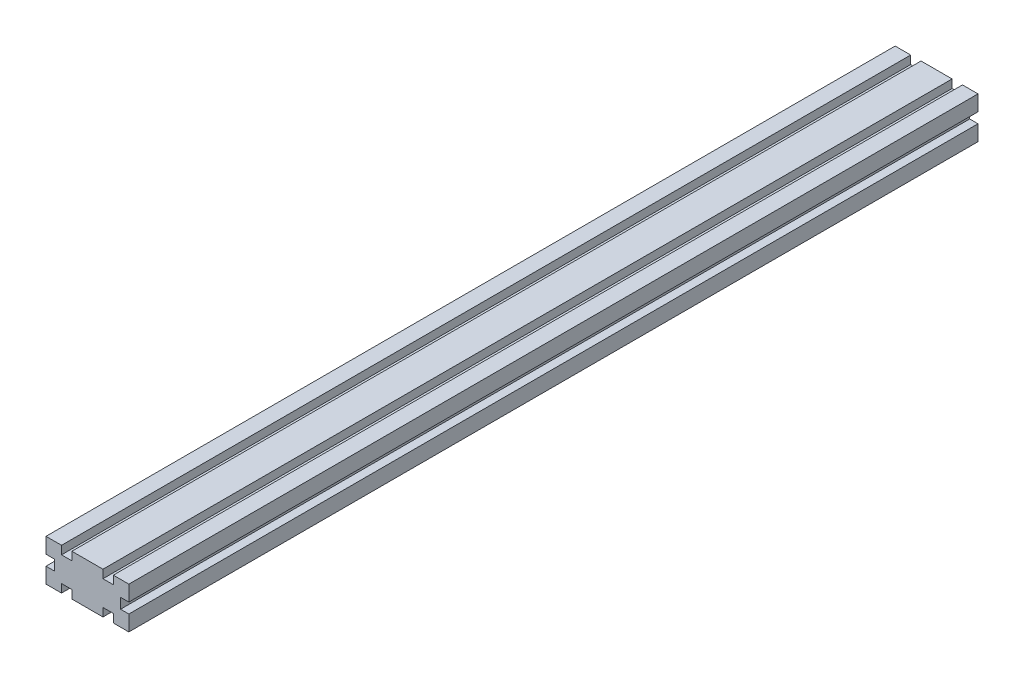
ISO-10303-21;
HEADER;
FILE_DESCRIPTION(('STEP AP214'),'2;1');
FILE_NAME('part.step','',(''),(''),'','','');
FILE_SCHEMA(('AUTOMOTIVE_DESIGN { 1 0 10303 214 1 1 1 1 }'));
ENDSEC;
DATA;
#1=APPLICATION_CONTEXT('core data for automotive mechanical design processes');
#2=APPLICATION_PROTOCOL_DEFINITION('international standard','automotive_design',2000,#1);
#3=PRODUCT_CONTEXT('',#1,'mechanical');
#4=PRODUCT('Part','Part','',(#3));
#5=PRODUCT_RELATED_PRODUCT_CATEGORY('part','',(#4));
#6=PRODUCT_DEFINITION_FORMATION('','',#4);
#7=PRODUCT_DEFINITION_CONTEXT('part definition',#1,'design');
#8=PRODUCT_DEFINITION('design','',#6,#7);
#9=PRODUCT_DEFINITION_SHAPE('','',#8);
#10=(LENGTH_UNIT() NAMED_UNIT(*) SI_UNIT(.MILLI.,.METRE.));
#11=(NAMED_UNIT(*) PLANE_ANGLE_UNIT() SI_UNIT($,.RADIAN.));
#12=(NAMED_UNIT(*) SI_UNIT($,.STERADIAN.) SOLID_ANGLE_UNIT());
#13=UNCERTAINTY_MEASURE_WITH_UNIT(LENGTH_MEASURE(1.E-05),#10,'distance_accuracy_value','');
#14=(GEOMETRIC_REPRESENTATION_CONTEXT(3) GLOBAL_UNCERTAINTY_ASSIGNED_CONTEXT((#13)) GLOBAL_UNIT_ASSIGNED_CONTEXT((#10,
#11,#12)) REPRESENTATION_CONTEXT('',''));
#15=CARTESIAN_POINT('',(0.,0.,0.));
#16=DIRECTION('',(0.,0.,1.));
#17=DIRECTION('',(1.,0.,0.));
#18=AXIS2_PLACEMENT_3D('',#15,#16,#17);
#19=CARTESIAN_POINT('',(40.,0.,410.));
#20=DIRECTION('',(-1.,0.,0.));
#21=DIRECTION('',(0.,0.,1.));
#22=AXIS2_PLACEMENT_3D('',#19,#20,#21);
#23=PLANE('',#22);
#24=DIRECTION('',(0.,1.,0.));
#25=VECTOR('',#24,1.);
#26=CARTESIAN_POINT('',(40.,0.,0.));
#27=LINE('',#26,#25);
#28=CARTESIAN_POINT('',(40.,12.5,0.));
#29=VERTEX_POINT('',#28);
#30=CARTESIAN_POINT('',(40.,20.,0.));
#31=VERTEX_POINT('',#30);
#32=EDGE_CURVE('E257',#29,#31,#27,.T.);
#33=ORIENTED_EDGE('',*,*,#32,.T.);
#34=DIRECTION('',(0.,0.,-1.));
#35=VECTOR('',#34,1.);
#36=CARTESIAN_POINT('',(40.,20.,410.));
#37=LINE('',#36,#35);
#38=CARTESIAN_POINT('',(40.,20.,410.));
#39=VERTEX_POINT('',#38);
#40=EDGE_CURVE('E11',#39,#31,#37,.T.);
#41=ORIENTED_EDGE('',*,*,#40,.F.);
#42=DIRECTION('',(0.,1.,0.));
#43=VECTOR('',#42,1.);
#44=CARTESIAN_POINT('',(40.,0.,410.));
#45=LINE('',#44,#43);
#46=CARTESIAN_POINT('',(40.,12.5,410.));
#47=VERTEX_POINT('',#46);
#48=EDGE_CURVE('E156',#47,#39,#45,.T.);
#49=ORIENTED_EDGE('',*,*,#48,.F.);
#50=DIRECTION('',(0.,0.,-1.));
#51=VECTOR('',#50,1.);
#52=CARTESIAN_POINT('',(40.,12.5,410.));
#53=LINE('',#52,#51);
#54=EDGE_CURVE('E256',#47,#29,#53,.T.);
#55=ORIENTED_EDGE('',*,*,#54,.T.);
#56=EDGE_LOOP('',(#33,#41,#49,#55));
#57=FACE_BOUND('',#56,.T.);
#58=ADVANCED_FACE('F41',(#57),#23,.F.);
#59=CARTESIAN_POINT('',(0.,20.,410.));
#60=DIRECTION('',(0.,1.,0.));
#61=DIRECTION('',(0.,0.,1.));
#62=AXIS2_PLACEMENT_3D('',#59,#60,#61);
#63=PLANE('',#62);
#64=DIRECTION('',(1.,0.,0.));
#65=VECTOR('',#64,1.);
#66=CARTESIAN_POINT('',(0.,20.,0.));
#67=LINE('',#66,#65);
#68=CARTESIAN_POINT('',(32.5,20.,0.));
#69=VERTEX_POINT('',#68);
#70=EDGE_CURVE('E260',#69,#31,#67,.T.);
#71=ORIENTED_EDGE('',*,*,#70,.F.);
#72=DIRECTION('',(0.,0.,-1.));
#73=VECTOR('',#72,1.);
#74=CARTESIAN_POINT('',(32.5,20.,410.));
#75=LINE('',#74,#73);
#76=CARTESIAN_POINT('',(32.5,20.,410.));
#77=VERTEX_POINT('',#76);
#78=EDGE_CURVE('E49',#77,#69,#75,.T.);
#79=ORIENTED_EDGE('',*,*,#78,.F.);
#80=DIRECTION('',(1.,0.,0.));
#81=VECTOR('',#80,1.);
#82=CARTESIAN_POINT('',(0.,20.,410.));
#83=LINE('',#82,#81);
#84=EDGE_CURVE('E402',#77,#39,#83,.T.);
#85=ORIENTED_EDGE('',*,*,#84,.T.);
#86=ORIENTED_EDGE('',*,*,#40,.T.);
#87=EDGE_LOOP('',(#71,#79,#85,#86));
#88=FACE_BOUND('',#87,.T.);
#89=ADVANCED_FACE('F390',(#88),#63,.T.);
#90=CARTESIAN_POINT('',(32.5,0.,410.));
#91=DIRECTION('',(-1.,0.,0.));
#92=DIRECTION('',(0.,0.,1.));
#93=AXIS2_PLACEMENT_3D('',#90,#91,#92);
#94=PLANE('',#93);
#95=DIRECTION('',(0.,1.,0.));
#96=VECTOR('',#95,1.);
#97=CARTESIAN_POINT('',(32.5,0.,0.));
#98=LINE('',#97,#96);
#99=CARTESIAN_POINT('',(32.5,16.,0.));
#100=VERTEX_POINT('',#99);
#101=EDGE_CURVE('E263',#100,#69,#98,.T.);
#102=ORIENTED_EDGE('',*,*,#101,.F.);
#103=DIRECTION('',(0.,0.,-1.));
#104=VECTOR('',#103,1.);
#105=CARTESIAN_POINT('',(32.5,16.,410.));
#106=LINE('',#105,#104);
#107=CARTESIAN_POINT('',(32.5,16.,410.));
#108=VERTEX_POINT('',#107);
#109=EDGE_CURVE('E380',#108,#100,#106,.T.);
#110=ORIENTED_EDGE('',*,*,#109,.F.);
#111=DIRECTION('',(0.,1.,0.));
#112=VECTOR('',#111,1.);
#113=CARTESIAN_POINT('',(32.5,0.,410.));
#114=LINE('',#113,#112);
#115=EDGE_CURVE('E387',#108,#77,#114,.T.);
#116=ORIENTED_EDGE('',*,*,#115,.T.);
#117=ORIENTED_EDGE('',*,*,#78,.T.);
#118=EDGE_LOOP('',(#102,#110,#116,#117));
#119=FACE_BOUND('',#118,.T.);
#120=ADVANCED_FACE('F385',(#119),#94,.T.);
#121=CARTESIAN_POINT('',(0.,16.,410.));
#122=DIRECTION('',(0.,1.,0.));
#123=DIRECTION('',(0.,0.,1.));
#124=AXIS2_PLACEMENT_3D('',#121,#122,#123);
#125=PLANE('',#124);
#126=DIRECTION('',(1.,0.,0.));
#127=VECTOR('',#126,1.);
#128=CARTESIAN_POINT('',(0.,16.,0.));
#129=LINE('',#128,#127);
#130=CARTESIAN_POINT('',(27.5,16.,0.));
#131=VERTEX_POINT('',#130);
#132=EDGE_CURVE('E266',#131,#100,#129,.T.);
#133=ORIENTED_EDGE('',*,*,#132,.F.);
#134=DIRECTION('',(0.,0.,-1.));
#135=VECTOR('',#134,1.);
#136=CARTESIAN_POINT('',(27.5,16.,410.));
#137=LINE('',#136,#135);
#138=CARTESIAN_POINT('',(27.5,16.,410.));
#139=VERTEX_POINT('',#138);
#140=EDGE_CURVE('E378',#139,#131,#137,.T.);
#141=ORIENTED_EDGE('',*,*,#140,.F.);
#142=DIRECTION('',(1.,0.,0.));
#143=VECTOR('',#142,1.);
#144=CARTESIAN_POINT('',(0.,16.,410.));
#145=LINE('',#144,#143);
#146=EDGE_CURVE('E401',#139,#108,#145,.T.);
#147=ORIENTED_EDGE('',*,*,#146,.T.);
#148=ORIENTED_EDGE('',*,*,#109,.T.);
#149=EDGE_LOOP('',(#133,#141,#147,#148));
#150=FACE_BOUND('',#149,.T.);
#151=ADVANCED_FACE('F397',(#150),#125,.T.);
#152=CARTESIAN_POINT('',(27.5,0.,410.));
#153=DIRECTION('',(-1.,0.,0.));
#154=DIRECTION('',(0.,0.,1.));
#155=AXIS2_PLACEMENT_3D('',#152,#153,#154);
#156=PLANE('',#155);
#157=DIRECTION('',(0.,1.,0.));
#158=VECTOR('',#157,1.);
#159=CARTESIAN_POINT('',(27.5,0.,0.));
#160=LINE('',#159,#158);
#161=CARTESIAN_POINT('',(27.5,20.,0.));
#162=VERTEX_POINT('',#161);
#163=EDGE_CURVE('E269',#131,#162,#160,.T.);
#164=ORIENTED_EDGE('',*,*,#163,.T.);
#165=DIRECTION('',(0.,0.,-1.));
#166=VECTOR('',#165,1.);
#167=CARTESIAN_POINT('',(27.5,20.,410.));
#168=LINE('',#167,#166);
#169=CARTESIAN_POINT('',(27.5,20.,410.));
#170=VERTEX_POINT('',#169);
#171=EDGE_CURVE('E376',#170,#162,#168,.T.);
#172=ORIENTED_EDGE('',*,*,#171,.F.);
#173=DIRECTION('',(0.,1.,0.));
#174=VECTOR('',#173,1.);
#175=CARTESIAN_POINT('',(27.5,0.,410.));
#176=LINE('',#175,#174);
#177=EDGE_CURVE('E404',#139,#170,#176,.T.);
#178=ORIENTED_EDGE('',*,*,#177,.F.);
#179=ORIENTED_EDGE('',*,*,#140,.T.);
#180=EDGE_LOOP('',(#164,#172,#178,#179));
#181=FACE_BOUND('',#180,.T.);
#182=ADVANCED_FACE('F486',(#181),#156,.F.);
#183=CARTESIAN_POINT('',(0.,20.,410.));
#184=DIRECTION('',(0.,1.,0.));
#185=DIRECTION('',(0.,0.,1.));
#186=AXIS2_PLACEMENT_3D('',#183,#184,#185);
#187=PLANE('',#186);
#188=DIRECTION('',(1.,0.,0.));
#189=VECTOR('',#188,1.);
#190=CARTESIAN_POINT('',(0.,20.,0.));
#191=LINE('',#190,#189);
#192=CARTESIAN_POINT('',(12.5,20.,0.));
#193=VERTEX_POINT('',#192);
#194=EDGE_CURVE('E272',#193,#162,#191,.T.);
#195=ORIENTED_EDGE('',*,*,#194,.F.);
#196=DIRECTION('',(0.,0.,-1.));
#197=VECTOR('',#196,1.);
#198=CARTESIAN_POINT('',(12.5,20.,410.));
#199=LINE('',#198,#197);
#200=CARTESIAN_POINT('',(12.5,20.,410.));
#201=VERTEX_POINT('',#200);
#202=EDGE_CURVE('E374',#201,#193,#199,.T.);
#203=ORIENTED_EDGE('',*,*,#202,.F.);
#204=DIRECTION('',(1.,0.,0.));
#205=VECTOR('',#204,1.);
#206=CARTESIAN_POINT('',(0.,20.,410.));
#207=LINE('',#206,#205);
#208=EDGE_CURVE('E410',#201,#170,#207,.T.);
#209=ORIENTED_EDGE('',*,*,#208,.T.);
#210=ORIENTED_EDGE('',*,*,#171,.T.);
#211=EDGE_LOOP('',(#195,#203,#209,#210));
#212=FACE_BOUND('',#211,.T.);
#213=ADVANCED_FACE('F489',(#212),#187,.T.);
#214=CARTESIAN_POINT('',(12.5,0.,410.));
#215=DIRECTION('',(-1.,0.,0.));
#216=DIRECTION('',(0.,0.,1.));
#217=AXIS2_PLACEMENT_3D('',#214,#215,#216);
#218=PLANE('',#217);
#219=DIRECTION('',(0.,1.,0.));
#220=VECTOR('',#219,1.);
#221=CARTESIAN_POINT('',(12.5,0.,0.));
#222=LINE('',#221,#220);
#223=CARTESIAN_POINT('',(12.5,16.,0.));
#224=VERTEX_POINT('',#223);
#225=EDGE_CURVE('E275',#224,#193,#222,.T.);
#226=ORIENTED_EDGE('',*,*,#225,.F.);
#227=DIRECTION('',(0.,0.,-1.));
#228=VECTOR('',#227,1.);
#229=CARTESIAN_POINT('',(12.5,16.,410.));
#230=LINE('',#229,#228);
#231=CARTESIAN_POINT('',(12.5,16.,410.));
#232=VERTEX_POINT('',#231);
#233=EDGE_CURVE('E372',#232,#224,#230,.T.);
#234=ORIENTED_EDGE('',*,*,#233,.F.);
#235=DIRECTION('',(0.,1.,0.));
#236=VECTOR('',#235,1.);
#237=CARTESIAN_POINT('',(12.5,0.,410.));
#238=LINE('',#237,#236);
#239=EDGE_CURVE('E413',#232,#201,#238,.T.);
#240=ORIENTED_EDGE('',*,*,#239,.T.);
#241=ORIENTED_EDGE('',*,*,#202,.T.);
#242=EDGE_LOOP('',(#226,#234,#240,#241));
#243=FACE_BOUND('',#242,.T.);
#244=ADVANCED_FACE('F493',(#243),#218,.T.);
#245=CARTESIAN_POINT('',(0.,16.,410.));
#246=DIRECTION('',(0.,1.,0.));
#247=DIRECTION('',(0.,0.,1.));
#248=AXIS2_PLACEMENT_3D('',#245,#246,#247);
#249=PLANE('',#248);
#250=DIRECTION('',(1.,0.,0.));
#251=VECTOR('',#250,1.);
#252=CARTESIAN_POINT('',(0.,16.,0.));
#253=LINE('',#252,#251);
#254=CARTESIAN_POINT('',(7.5,16.,0.));
#255=VERTEX_POINT('',#254);
#256=EDGE_CURVE('E278',#255,#224,#253,.T.);
#257=ORIENTED_EDGE('',*,*,#256,.F.);
#258=DIRECTION('',(0.,0.,-1.));
#259=VECTOR('',#258,1.);
#260=CARTESIAN_POINT('',(7.5,16.,410.));
#261=LINE('',#260,#259);
#262=CARTESIAN_POINT('',(7.5,16.,410.));
#263=VERTEX_POINT('',#262);
#264=EDGE_CURVE('E370',#263,#255,#261,.T.);
#265=ORIENTED_EDGE('',*,*,#264,.F.);
#266=DIRECTION('',(1.,0.,0.));
#267=VECTOR('',#266,1.);
#268=CARTESIAN_POINT('',(0.,16.,410.));
#269=LINE('',#268,#267);
#270=EDGE_CURVE('E416',#263,#232,#269,.T.);
#271=ORIENTED_EDGE('',*,*,#270,.T.);
#272=ORIENTED_EDGE('',*,*,#233,.T.);
#273=EDGE_LOOP('',(#257,#265,#271,#272));
#274=FACE_BOUND('',#273,.T.);
#275=ADVANCED_FACE('F497',(#274),#249,.T.);
#276=CARTESIAN_POINT('',(7.5,0.,410.));
#277=DIRECTION('',(-1.,0.,0.));
#278=DIRECTION('',(0.,0.,1.));
#279=AXIS2_PLACEMENT_3D('',#276,#277,#278);
#280=PLANE('',#279);
#281=DIRECTION('',(0.,1.,0.));
#282=VECTOR('',#281,1.);
#283=CARTESIAN_POINT('',(7.5,0.,0.));
#284=LINE('',#283,#282);
#285=CARTESIAN_POINT('',(7.5,20.,0.));
#286=VERTEX_POINT('',#285);
#287=EDGE_CURVE('E281',#255,#286,#284,.T.);
#288=ORIENTED_EDGE('',*,*,#287,.T.);
#289=DIRECTION('',(0.,0.,-1.));
#290=VECTOR('',#289,1.);
#291=CARTESIAN_POINT('',(7.5,20.,410.));
#292=LINE('',#291,#290);
#293=CARTESIAN_POINT('',(7.5,20.,410.));
#294=VERTEX_POINT('',#293);
#295=EDGE_CURVE('E368',#294,#286,#292,.T.);
#296=ORIENTED_EDGE('',*,*,#295,.F.);
#297=DIRECTION('',(0.,1.,0.));
#298=VECTOR('',#297,1.);
#299=CARTESIAN_POINT('',(7.5,0.,410.));
#300=LINE('',#299,#298);
#301=EDGE_CURVE('E419',#263,#294,#300,.T.);
#302=ORIENTED_EDGE('',*,*,#301,.F.);
#303=ORIENTED_EDGE('',*,*,#264,.T.);
#304=EDGE_LOOP('',(#288,#296,#302,#303));
#305=FACE_BOUND('',#304,.T.);
#306=ADVANCED_FACE('F501',(#305),#280,.F.);
#307=CARTESIAN_POINT('',(0.,20.,410.));
#308=DIRECTION('',(0.,1.,0.));
#309=DIRECTION('',(0.,0.,1.));
#310=AXIS2_PLACEMENT_3D('',#307,#308,#309);
#311=PLANE('',#310);
#312=DIRECTION('',(1.,0.,0.));
#313=VECTOR('',#312,1.);
#314=CARTESIAN_POINT('',(0.,20.,0.));
#315=LINE('',#314,#313);
#316=CARTESIAN_POINT('',(0.,20.,0.));
#317=VERTEX_POINT('',#316);
#318=EDGE_CURVE('E284',#317,#286,#315,.T.);
#319=ORIENTED_EDGE('',*,*,#318,.F.);
#320=DIRECTION('',(0.,0.,-1.));
#321=VECTOR('',#320,1.);
#322=CARTESIAN_POINT('',(0.,20.,410.));
#323=LINE('',#322,#321);
#324=CARTESIAN_POINT('',(0.,20.,410.));
#325=VERTEX_POINT('',#324);
#326=EDGE_CURVE('E366',#325,#317,#323,.T.);
#327=ORIENTED_EDGE('',*,*,#326,.F.);
#328=DIRECTION('',(1.,0.,0.));
#329=VECTOR('',#328,1.);
#330=CARTESIAN_POINT('',(0.,20.,410.));
#331=LINE('',#330,#329);
#332=EDGE_CURVE('E421',#325,#294,#331,.T.);
#333=ORIENTED_EDGE('',*,*,#332,.T.);
#334=ORIENTED_EDGE('',*,*,#295,.T.);
#335=EDGE_LOOP('',(#319,#327,#333,#334));
#336=FACE_BOUND('',#335,.T.);
#337=ADVANCED_FACE('F505',(#336),#311,.T.);
#338=CARTESIAN_POINT('',(0.,0.,410.));
#339=DIRECTION('',(-1.,0.,0.));
#340=DIRECTION('',(0.,0.,1.));
#341=AXIS2_PLACEMENT_3D('',#338,#339,#340);
#342=PLANE('',#341);
#343=DIRECTION('',(0.,1.,0.));
#344=VECTOR('',#343,1.);
#345=CARTESIAN_POINT('',(0.,0.,0.));
#346=LINE('',#345,#344);
#347=CARTESIAN_POINT('',(0.,12.5,0.));
#348=VERTEX_POINT('',#347);
#349=EDGE_CURVE('E287',#348,#317,#346,.T.);
#350=ORIENTED_EDGE('',*,*,#349,.F.);
#351=DIRECTION('',(0.,0.,-1.));
#352=VECTOR('',#351,1.);
#353=CARTESIAN_POINT('',(0.,12.5,410.));
#354=LINE('',#353,#352);
#355=CARTESIAN_POINT('',(0.,12.5,410.));
#356=VERTEX_POINT('',#355);
#357=EDGE_CURVE('E364',#356,#348,#354,.T.);
#358=ORIENTED_EDGE('',*,*,#357,.F.);
#359=DIRECTION('',(0.,1.,0.));
#360=VECTOR('',#359,1.);
#361=CARTESIAN_POINT('',(0.,0.,410.));
#362=LINE('',#361,#360);
#363=EDGE_CURVE('E424',#356,#325,#362,.T.);
#364=ORIENTED_EDGE('',*,*,#363,.T.);
#365=ORIENTED_EDGE('',*,*,#326,.T.);
#366=EDGE_LOOP('',(#350,#358,#364,#365));
#367=FACE_BOUND('',#366,.T.);
#368=ADVANCED_FACE('F509',(#367),#342,.T.);
#369=CARTESIAN_POINT('',(0.,12.5,410.));
#370=DIRECTION('',(0.,1.,0.));
#371=DIRECTION('',(-1.,0.,0.));
#372=AXIS2_PLACEMENT_3D('',#369,#370,#371);
#373=PLANE('',#372);
#374=DIRECTION('',(1.,0.,0.));
#375=VECTOR('',#374,1.);
#376=CARTESIAN_POINT('',(0.,12.5,0.));
#377=LINE('',#376,#375);
#378=CARTESIAN_POINT('',(4.,12.5,0.));
#379=VERTEX_POINT('',#378);
#380=EDGE_CURVE('E290',#348,#379,#377,.T.);
#381=ORIENTED_EDGE('',*,*,#380,.T.);
#382=DIRECTION('',(0.,0.,-1.));
#383=VECTOR('',#382,1.);
#384=CARTESIAN_POINT('',(4.,12.5,410.));
#385=LINE('',#384,#383);
#386=CARTESIAN_POINT('',(4.,12.5,410.));
#387=VERTEX_POINT('',#386);
#388=EDGE_CURVE('E362',#387,#379,#385,.T.);
#389=ORIENTED_EDGE('',*,*,#388,.F.);
#390=DIRECTION('',(1.,0.,0.));
#391=VECTOR('',#390,1.);
#392=CARTESIAN_POINT('',(0.,12.5,410.));
#393=LINE('',#392,#391);
#394=EDGE_CURVE('E427',#356,#387,#393,.T.);
#395=ORIENTED_EDGE('',*,*,#394,.F.);
#396=ORIENTED_EDGE('',*,*,#357,.T.);
#397=EDGE_LOOP('',(#381,#389,#395,#396));
#398=FACE_BOUND('',#397,.T.);
#399=ADVANCED_FACE('F513',(#398),#373,.F.);
#400=CARTESIAN_POINT('',(4.,0.,410.));
#401=DIRECTION('',(-1.,0.,0.));
#402=DIRECTION('',(0.,0.,1.));
#403=AXIS2_PLACEMENT_3D('',#400,#401,#402);
#404=PLANE('',#403);
#405=DIRECTION('',(0.,1.,0.));
#406=VECTOR('',#405,1.);
#407=CARTESIAN_POINT('',(4.,0.,0.));
#408=LINE('',#407,#406);
#409=CARTESIAN_POINT('',(4.,7.5,0.));
#410=VERTEX_POINT('',#409);
#411=EDGE_CURVE('E293',#410,#379,#408,.T.);
#412=ORIENTED_EDGE('',*,*,#411,.F.);
#413=DIRECTION('',(0.,0.,-1.));
#414=VECTOR('',#413,1.);
#415=CARTESIAN_POINT('',(4.,7.5,410.));
#416=LINE('',#415,#414);
#417=CARTESIAN_POINT('',(4.,7.5,410.));
#418=VERTEX_POINT('',#417);
#419=EDGE_CURVE('E360',#418,#410,#416,.T.);
#420=ORIENTED_EDGE('',*,*,#419,.F.);
#421=DIRECTION('',(0.,1.,0.));
#422=VECTOR('',#421,1.);
#423=CARTESIAN_POINT('',(4.,0.,410.));
#424=LINE('',#423,#422);
#425=EDGE_CURVE('E429',#418,#387,#424,.T.);
#426=ORIENTED_EDGE('',*,*,#425,.T.);
#427=ORIENTED_EDGE('',*,*,#388,.T.);
#428=EDGE_LOOP('',(#412,#420,#426,#427));
#429=FACE_BOUND('',#428,.T.);
#430=ADVANCED_FACE('F517',(#429),#404,.T.);
#431=CARTESIAN_POINT('',(0.,7.5,410.));
#432=DIRECTION('',(0.,1.,0.));
#433=DIRECTION('',(-1.,0.,0.));
#434=AXIS2_PLACEMENT_3D('',#431,#432,#433);
#435=PLANE('',#434);
#436=DIRECTION('',(1.,0.,0.));
#437=VECTOR('',#436,1.);
#438=CARTESIAN_POINT('',(0.,7.5,0.));
#439=LINE('',#438,#437);
#440=CARTESIAN_POINT('',(0.,7.5,0.));
#441=VERTEX_POINT('',#440);
#442=EDGE_CURVE('E296',#441,#410,#439,.T.);
#443=ORIENTED_EDGE('',*,*,#442,.F.);
#444=DIRECTION('',(0.,0.,-1.));
#445=VECTOR('',#444,1.);
#446=CARTESIAN_POINT('',(0.,7.5,410.));
#447=LINE('',#446,#445);
#448=CARTESIAN_POINT('',(0.,7.5,410.));
#449=VERTEX_POINT('',#448);
#450=EDGE_CURVE('E358',#449,#441,#447,.T.);
#451=ORIENTED_EDGE('',*,*,#450,.F.);
#452=DIRECTION('',(1.,0.,0.));
#453=VECTOR('',#452,1.);
#454=CARTESIAN_POINT('',(0.,7.5,410.));
#455=LINE('',#454,#453);
#456=EDGE_CURVE('E432',#449,#418,#455,.T.);
#457=ORIENTED_EDGE('',*,*,#456,.T.);
#458=ORIENTED_EDGE('',*,*,#419,.T.);
#459=EDGE_LOOP('',(#443,#451,#457,#458));
#460=FACE_BOUND('',#459,.T.);
#461=ADVANCED_FACE('F521',(#460),#435,.T.);
#462=CARTESIAN_POINT('',(0.,0.,410.));
#463=DIRECTION('',(-1.,0.,0.));
#464=DIRECTION('',(0.,0.,1.));
#465=AXIS2_PLACEMENT_3D('',#462,#463,#464);
#466=PLANE('',#465);
#467=DIRECTION('',(0.,1.,0.));
#468=VECTOR('',#467,1.);
#469=CARTESIAN_POINT('',(0.,0.,0.));
#470=LINE('',#469,#468);
#471=CARTESIAN_POINT('',(0.,0.,0.));
#472=VERTEX_POINT('',#471);
#473=EDGE_CURVE('E299',#472,#441,#470,.T.);
#474=ORIENTED_EDGE('',*,*,#473,.F.);
#475=DIRECTION('',(0.,0.,-1.));
#476=VECTOR('',#475,1.);
#477=CARTESIAN_POINT('',(0.,0.,410.));
#478=LINE('',#477,#476);
#479=CARTESIAN_POINT('',(0.,0.,410.));
#480=VERTEX_POINT('',#479);
#481=EDGE_CURVE('E356',#480,#472,#478,.T.);
#482=ORIENTED_EDGE('',*,*,#481,.F.);
#483=DIRECTION('',(0.,1.,0.));
#484=VECTOR('',#483,1.);
#485=CARTESIAN_POINT('',(0.,0.,410.));
#486=LINE('',#485,#484);
#487=EDGE_CURVE('E435',#480,#449,#486,.T.);
#488=ORIENTED_EDGE('',*,*,#487,.T.);
#489=ORIENTED_EDGE('',*,*,#450,.T.);
#490=EDGE_LOOP('',(#474,#482,#488,#489));
#491=FACE_BOUND('',#490,.T.);
#492=ADVANCED_FACE('F525',(#491),#466,.T.);
#493=CARTESIAN_POINT('',(0.,0.,410.));
#494=DIRECTION('',(0.,1.,0.));
#495=DIRECTION('',(0.,0.,1.));
#496=AXIS2_PLACEMENT_3D('',#493,#494,#495);
#497=PLANE('',#496);
#498=DIRECTION('',(1.,0.,0.));
#499=VECTOR('',#498,1.);
#500=CARTESIAN_POINT('',(0.,0.,0.));
#501=LINE('',#500,#499);
#502=CARTESIAN_POINT('',(7.5,0.,0.));
#503=VERTEX_POINT('',#502);
#504=EDGE_CURVE('E302',#472,#503,#501,.T.);
#505=ORIENTED_EDGE('',*,*,#504,.T.);
#506=DIRECTION('',(0.,0.,-1.));
#507=VECTOR('',#506,1.);
#508=CARTESIAN_POINT('',(7.5,0.,410.));
#509=LINE('',#508,#507);
#510=CARTESIAN_POINT('',(7.5,0.,410.));
#511=VERTEX_POINT('',#510);
#512=EDGE_CURVE('E353',#511,#503,#509,.T.);
#513=ORIENTED_EDGE('',*,*,#512,.F.);
#514=DIRECTION('',(1.,0.,0.));
#515=VECTOR('',#514,1.);
#516=CARTESIAN_POINT('',(0.,0.,410.));
#517=LINE('',#516,#515);
#518=EDGE_CURVE('E438',#480,#511,#517,.T.);
#519=ORIENTED_EDGE('',*,*,#518,.F.);
#520=ORIENTED_EDGE('',*,*,#481,.T.);
#521=EDGE_LOOP('',(#505,#513,#519,#520));
#522=FACE_BOUND('',#521,.T.);
#523=ADVANCED_FACE('F529',(#522),#497,.F.);
#524=CARTESIAN_POINT('',(7.5,0.,410.));
#525=DIRECTION('',(-1.,0.,0.));
#526=DIRECTION('',(0.,0.,1.));
#527=AXIS2_PLACEMENT_3D('',#524,#525,#526);
#528=PLANE('',#527);
#529=DIRECTION('',(0.,1.,0.));
#530=VECTOR('',#529,1.);
#531=CARTESIAN_POINT('',(7.5,0.,0.));
#532=LINE('',#531,#530);
#533=CARTESIAN_POINT('',(7.5,4.,0.));
#534=VERTEX_POINT('',#533);
#535=EDGE_CURVE('E304',#503,#534,#532,.T.);
#536=ORIENTED_EDGE('',*,*,#535,.T.);
#537=DIRECTION('',(0.,0.,-1.));
#538=VECTOR('',#537,1.);
#539=CARTESIAN_POINT('',(7.5,4.,410.));
#540=LINE('',#539,#538);
#541=CARTESIAN_POINT('',(7.5,4.,410.));
#542=VERTEX_POINT('',#541);
#543=EDGE_CURVE('E350',#542,#534,#540,.T.);
#544=ORIENTED_EDGE('',*,*,#543,.F.);
#545=DIRECTION('',(0.,1.,0.));
#546=VECTOR('',#545,1.);
#547=CARTESIAN_POINT('',(7.5,0.,410.));
#548=LINE('',#547,#546);
#549=EDGE_CURVE('E440',#511,#542,#548,.T.);
#550=ORIENTED_EDGE('',*,*,#549,.F.);
#551=ORIENTED_EDGE('',*,*,#512,.T.);
#552=EDGE_LOOP('',(#536,#544,#550,#551));
#553=FACE_BOUND('',#552,.T.);
#554=ADVANCED_FACE('F533',(#553),#528,.F.);
#555=CARTESIAN_POINT('',(0.,4.,410.));
#556=DIRECTION('',(0.,1.,0.));
#557=DIRECTION('',(0.,0.,1.));
#558=AXIS2_PLACEMENT_3D('',#555,#556,#557);
#559=PLANE('',#558);
#560=DIRECTION('',(1.,0.,0.));
#561=VECTOR('',#560,1.);
#562=CARTESIAN_POINT('',(0.,4.,0.));
#563=LINE('',#562,#561);
#564=CARTESIAN_POINT('',(12.5,4.,0.));
#565=VERTEX_POINT('',#564);
#566=EDGE_CURVE('E306',#534,#565,#563,.T.);
#567=ORIENTED_EDGE('',*,*,#566,.T.);
#568=DIRECTION('',(0.,0.,-1.));
#569=VECTOR('',#568,1.);
#570=CARTESIAN_POINT('',(12.5,4.,410.));
#571=LINE('',#570,#569);
#572=CARTESIAN_POINT('',(12.5,4.,410.));
#573=VERTEX_POINT('',#572);
#574=EDGE_CURVE('E348',#573,#565,#571,.T.);
#575=ORIENTED_EDGE('',*,*,#574,.F.);
#576=DIRECTION('',(1.,0.,0.));
#577=VECTOR('',#576,1.);
#578=CARTESIAN_POINT('',(0.,4.,410.));
#579=LINE('',#578,#577);
#580=EDGE_CURVE('E442',#542,#573,#579,.T.);
#581=ORIENTED_EDGE('',*,*,#580,.F.);
#582=ORIENTED_EDGE('',*,*,#543,.T.);
#583=EDGE_LOOP('',(#567,#575,#581,#582));
#584=FACE_BOUND('',#583,.T.);
#585=ADVANCED_FACE('F537',(#584),#559,.F.);
#586=CARTESIAN_POINT('',(12.5,0.,410.));
#587=DIRECTION('',(-1.,0.,0.));
#588=DIRECTION('',(0.,0.,1.));
#589=AXIS2_PLACEMENT_3D('',#586,#587,#588);
#590=PLANE('',#589);
#591=DIRECTION('',(0.,1.,0.));
#592=VECTOR('',#591,1.);
#593=CARTESIAN_POINT('',(12.5,0.,0.));
#594=LINE('',#593,#592);
#595=CARTESIAN_POINT('',(12.5,0.,0.));
#596=VERTEX_POINT('',#595);
#597=EDGE_CURVE('E309',#596,#565,#594,.T.);
#598=ORIENTED_EDGE('',*,*,#597,.F.);
#599=DIRECTION('',(0.,0.,-1.));
#600=VECTOR('',#599,1.);
#601=CARTESIAN_POINT('',(12.5,0.,410.));
#602=LINE('',#601,#600);
#603=CARTESIAN_POINT('',(12.5,0.,410.));
#604=VERTEX_POINT('',#603);
#605=EDGE_CURVE('E346',#604,#596,#602,.T.);
#606=ORIENTED_EDGE('',*,*,#605,.F.);
#607=DIRECTION('',(0.,1.,0.));
#608=VECTOR('',#607,1.);
#609=CARTESIAN_POINT('',(12.5,0.,410.));
#610=LINE('',#609,#608);
#611=EDGE_CURVE('E444',#604,#573,#610,.T.);
#612=ORIENTED_EDGE('',*,*,#611,.T.);
#613=ORIENTED_EDGE('',*,*,#574,.T.);
#614=EDGE_LOOP('',(#598,#606,#612,#613));
#615=FACE_BOUND('',#614,.T.);
#616=ADVANCED_FACE('F541',(#615),#590,.T.);
#617=CARTESIAN_POINT('',(0.,0.,410.));
#618=DIRECTION('',(0.,1.,0.));
#619=DIRECTION('',(0.,0.,1.));
#620=AXIS2_PLACEMENT_3D('',#617,#618,#619);
#621=PLANE('',#620);
#622=DIRECTION('',(1.,0.,0.));
#623=VECTOR('',#622,1.);
#624=CARTESIAN_POINT('',(0.,0.,0.));
#625=LINE('',#624,#623);
#626=CARTESIAN_POINT('',(27.5,0.,0.));
#627=VERTEX_POINT('',#626);
#628=EDGE_CURVE('E312',#596,#627,#625,.T.);
#629=ORIENTED_EDGE('',*,*,#628,.T.);
#630=DIRECTION('',(0.,0.,-1.));
#631=VECTOR('',#630,1.);
#632=CARTESIAN_POINT('',(27.5,0.,410.));
#633=LINE('',#632,#631);
#634=CARTESIAN_POINT('',(27.5,0.,410.));
#635=VERTEX_POINT('',#634);
#636=EDGE_CURVE('E343',#635,#627,#633,.T.);
#637=ORIENTED_EDGE('',*,*,#636,.F.);
#638=DIRECTION('',(1.,0.,0.));
#639=VECTOR('',#638,1.);
#640=CARTESIAN_POINT('',(0.,0.,410.));
#641=LINE('',#640,#639);
#642=EDGE_CURVE('E447',#604,#635,#641,.T.);
#643=ORIENTED_EDGE('',*,*,#642,.F.);
#644=ORIENTED_EDGE('',*,*,#605,.T.);
#645=EDGE_LOOP('',(#629,#637,#643,#644));
#646=FACE_BOUND('',#645,.T.);
#647=ADVANCED_FACE('F545',(#646),#621,.F.);
#648=CARTESIAN_POINT('',(27.5,0.,410.));
#649=DIRECTION('',(-1.,0.,0.));
#650=DIRECTION('',(0.,0.,1.));
#651=AXIS2_PLACEMENT_3D('',#648,#649,#650);
#652=PLANE('',#651);
#653=DIRECTION('',(0.,1.,0.));
#654=VECTOR('',#653,1.);
#655=CARTESIAN_POINT('',(27.5,0.,0.));
#656=LINE('',#655,#654);
#657=CARTESIAN_POINT('',(27.5,3.99999999999999,0.));
#658=VERTEX_POINT('',#657);
#659=EDGE_CURVE('E314',#627,#658,#656,.T.);
#660=ORIENTED_EDGE('',*,*,#659,.T.);
#661=DIRECTION('',(0.,0.,-1.));
#662=VECTOR('',#661,1.);
#663=CARTESIAN_POINT('',(27.5,3.99999999999999,410.));
#664=LINE('',#663,#662);
#665=CARTESIAN_POINT('',(27.5,3.99999999999999,410.));
#666=VERTEX_POINT('',#665);
#667=EDGE_CURVE('E340',#666,#658,#664,.T.);
#668=ORIENTED_EDGE('',*,*,#667,.F.);
#669=DIRECTION('',(0.,1.,0.));
#670=VECTOR('',#669,1.);
#671=CARTESIAN_POINT('',(27.5,0.,410.));
#672=LINE('',#671,#670);
#673=EDGE_CURVE('E449',#635,#666,#672,.T.);
#674=ORIENTED_EDGE('',*,*,#673,.F.);
#675=ORIENTED_EDGE('',*,*,#636,.T.);
#676=EDGE_LOOP('',(#660,#668,#674,#675));
#677=FACE_BOUND('',#676,.T.);
#678=ADVANCED_FACE('F549',(#677),#652,.F.);
#679=CARTESIAN_POINT('',(0.,3.99999999999999,410.));
#680=DIRECTION('',(0.,1.,0.));
#681=DIRECTION('',(0.,0.,1.));
#682=AXIS2_PLACEMENT_3D('',#679,#680,#681);
#683=PLANE('',#682);
#684=DIRECTION('',(1.,0.,0.));
#685=VECTOR('',#684,1.);
#686=CARTESIAN_POINT('',(0.,3.99999999999999,0.));
#687=LINE('',#686,#685);
#688=CARTESIAN_POINT('',(32.5,3.99999999999999,0.));
#689=VERTEX_POINT('',#688);
#690=EDGE_CURVE('E316',#658,#689,#687,.T.);
#691=ORIENTED_EDGE('',*,*,#690,.T.);
#692=DIRECTION('',(0.,0.,-1.));
#693=VECTOR('',#692,1.);
#694=CARTESIAN_POINT('',(32.5,3.99999999999999,410.));
#695=LINE('',#694,#693);
#696=CARTESIAN_POINT('',(32.5,3.99999999999999,410.));
#697=VERTEX_POINT('',#696);
#698=EDGE_CURVE('E338',#697,#689,#695,.T.);
#699=ORIENTED_EDGE('',*,*,#698,.F.);
#700=DIRECTION('',(1.,0.,0.));
#701=VECTOR('',#700,1.);
#702=CARTESIAN_POINT('',(0.,3.99999999999999,410.));
#703=LINE('',#702,#701);
#704=EDGE_CURVE('E451',#666,#697,#703,.T.);
#705=ORIENTED_EDGE('',*,*,#704,.F.);
#706=ORIENTED_EDGE('',*,*,#667,.T.);
#707=EDGE_LOOP('',(#691,#699,#705,#706));
#708=FACE_BOUND('',#707,.T.);
#709=ADVANCED_FACE('F553',(#708),#683,.F.);
#710=CARTESIAN_POINT('',(32.5,0.,410.));
#711=DIRECTION('',(-1.,0.,0.));
#712=DIRECTION('',(0.,0.,1.));
#713=AXIS2_PLACEMENT_3D('',#710,#711,#712);
#714=PLANE('',#713);
#715=DIRECTION('',(0.,1.,0.));
#716=VECTOR('',#715,1.);
#717=CARTESIAN_POINT('',(32.5,0.,0.));
#718=LINE('',#717,#716);
#719=CARTESIAN_POINT('',(32.5,0.,0.));
#720=VERTEX_POINT('',#719);
#721=EDGE_CURVE('E319',#720,#689,#718,.T.);
#722=ORIENTED_EDGE('',*,*,#721,.F.);
#723=DIRECTION('',(0.,0.,-1.));
#724=VECTOR('',#723,1.);
#725=CARTESIAN_POINT('',(32.5,0.,410.));
#726=LINE('',#725,#724);
#727=CARTESIAN_POINT('',(32.5,0.,410.));
#728=VERTEX_POINT('',#727);
#729=EDGE_CURVE('E336',#728,#720,#726,.T.);
#730=ORIENTED_EDGE('',*,*,#729,.F.);
#731=DIRECTION('',(0.,1.,0.));
#732=VECTOR('',#731,1.);
#733=CARTESIAN_POINT('',(32.5,0.,410.));
#734=LINE('',#733,#732);
#735=EDGE_CURVE('E453',#728,#697,#734,.T.);
#736=ORIENTED_EDGE('',*,*,#735,.T.);
#737=ORIENTED_EDGE('',*,*,#698,.T.);
#738=EDGE_LOOP('',(#722,#730,#736,#737));
#739=FACE_BOUND('',#738,.T.);
#740=ADVANCED_FACE('F557',(#739),#714,.T.);
#741=CARTESIAN_POINT('',(0.,0.,410.));
#742=DIRECTION('',(0.,1.,0.));
#743=DIRECTION('',(0.,0.,1.));
#744=AXIS2_PLACEMENT_3D('',#741,#742,#743);
#745=PLANE('',#744);
#746=DIRECTION('',(1.,0.,0.));
#747=VECTOR('',#746,1.);
#748=CARTESIAN_POINT('',(0.,0.,0.));
#749=LINE('',#748,#747);
#750=CARTESIAN_POINT('',(40.,0.,0.));
#751=VERTEX_POINT('',#750);
#752=EDGE_CURVE('E322',#720,#751,#749,.T.);
#753=ORIENTED_EDGE('',*,*,#752,.T.);
#754=DIRECTION('',(0.,0.,-1.));
#755=VECTOR('',#754,1.);
#756=CARTESIAN_POINT('',(40.,0.,410.));
#757=LINE('',#756,#755);
#758=CARTESIAN_POINT('',(40.,0.,410.));
#759=VERTEX_POINT('',#758);
#760=EDGE_CURVE('E333',#759,#751,#757,.T.);
#761=ORIENTED_EDGE('',*,*,#760,.F.);
#762=DIRECTION('',(1.,0.,0.));
#763=VECTOR('',#762,1.);
#764=CARTESIAN_POINT('',(0.,0.,410.));
#765=LINE('',#764,#763);
#766=EDGE_CURVE('E251',#728,#759,#765,.T.);
#767=ORIENTED_EDGE('',*,*,#766,.F.);
#768=ORIENTED_EDGE('',*,*,#729,.T.);
#769=EDGE_LOOP('',(#753,#761,#767,#768));
#770=FACE_BOUND('',#769,.T.);
#771=ADVANCED_FACE('F459',(#770),#745,.F.);
#772=CARTESIAN_POINT('',(40.,0.,410.));
#773=DIRECTION('',(-1.,0.,0.));
#774=DIRECTION('',(0.,0.,1.));
#775=AXIS2_PLACEMENT_3D('',#772,#773,#774);
#776=PLANE('',#775);
#777=DIRECTION('',(0.,1.,0.));
#778=VECTOR('',#777,1.);
#779=CARTESIAN_POINT('',(40.,0.,0.));
#780=LINE('',#779,#778);
#781=CARTESIAN_POINT('',(40.,7.5,0.));
#782=VERTEX_POINT('',#781);
#783=EDGE_CURVE('E324',#751,#782,#780,.T.);
#784=ORIENTED_EDGE('',*,*,#783,.T.);
#785=DIRECTION('',(0.,0.,-1.));
#786=VECTOR('',#785,1.);
#787=CARTESIAN_POINT('',(40.,7.5,410.));
#788=LINE('',#787,#786);
#789=CARTESIAN_POINT('',(40.,7.5,410.));
#790=VERTEX_POINT('',#789);
#791=EDGE_CURVE('E240',#790,#782,#788,.T.);
#792=ORIENTED_EDGE('',*,*,#791,.F.);
#793=DIRECTION('',(0.,1.,0.));
#794=VECTOR('',#793,1.);
#795=CARTESIAN_POINT('',(40.,0.,410.));
#796=LINE('',#795,#794);
#797=EDGE_CURVE('E248',#759,#790,#796,.T.);
#798=ORIENTED_EDGE('',*,*,#797,.F.);
#799=ORIENTED_EDGE('',*,*,#760,.T.);
#800=EDGE_LOOP('',(#784,#792,#798,#799));
#801=FACE_BOUND('',#800,.T.);
#802=ADVANCED_FACE('F463',(#801),#776,.F.);
#803=CARTESIAN_POINT('',(0.,7.5,410.));
#804=DIRECTION('',(0.,1.,0.));
#805=DIRECTION('',(-1.,0.,0.));
#806=AXIS2_PLACEMENT_3D('',#803,#804,#805);
#807=PLANE('',#806);
#808=DIRECTION('',(1.,0.,0.));
#809=VECTOR('',#808,1.);
#810=CARTESIAN_POINT('',(0.,7.5,0.));
#811=LINE('',#810,#809);
#812=CARTESIAN_POINT('',(36.,7.5,0.));
#813=VERTEX_POINT('',#812);
#814=EDGE_CURVE('E239',#813,#782,#811,.T.);
#815=ORIENTED_EDGE('',*,*,#814,.F.);
#816=DIRECTION('',(0.,0.,-1.));
#817=VECTOR('',#816,1.);
#818=CARTESIAN_POINT('',(36.,7.5,410.));
#819=LINE('',#818,#817);
#820=CARTESIAN_POINT('',(36.,7.5,410.));
#821=VERTEX_POINT('',#820);
#822=EDGE_CURVE('E233',#821,#813,#819,.T.);
#823=ORIENTED_EDGE('',*,*,#822,.F.);
#824=DIRECTION('',(1.,0.,0.));
#825=VECTOR('',#824,1.);
#826=CARTESIAN_POINT('',(0.,7.5,410.));
#827=LINE('',#826,#825);
#828=EDGE_CURVE('E237',#821,#790,#827,.T.);
#829=ORIENTED_EDGE('',*,*,#828,.T.);
#830=ORIENTED_EDGE('',*,*,#791,.T.);
#831=EDGE_LOOP('',(#815,#823,#829,#830));
#832=FACE_BOUND('',#831,.T.);
#833=ADVANCED_FACE('F235',(#832),#807,.T.);
#834=CARTESIAN_POINT('',(36.,0.,410.));
#835=DIRECTION('',(-1.,0.,0.));
#836=DIRECTION('',(0.,0.,1.));
#837=AXIS2_PLACEMENT_3D('',#834,#835,#836);
#838=PLANE('',#837);
#839=DIRECTION('',(0.,1.,0.));
#840=VECTOR('',#839,1.);
#841=CARTESIAN_POINT('',(36.,0.,0.));
#842=LINE('',#841,#840);
#843=CARTESIAN_POINT('',(36.,12.5,0.));
#844=VERTEX_POINT('',#843);
#845=EDGE_CURVE('E144',#813,#844,#842,.T.);
#846=ORIENTED_EDGE('',*,*,#845,.T.);
#847=DIRECTION('',(0.,0.,-1.));
#848=VECTOR('',#847,1.);
#849=CARTESIAN_POINT('',(36.,12.5,410.));
#850=LINE('',#849,#848);
#851=CARTESIAN_POINT('',(36.,12.5,410.));
#852=VERTEX_POINT('',#851);
#853=EDGE_CURVE('E241',#852,#844,#850,.T.);
#854=ORIENTED_EDGE('',*,*,#853,.F.);
#855=DIRECTION('',(0.,1.,0.));
#856=VECTOR('',#855,1.);
#857=CARTESIAN_POINT('',(36.,0.,410.));
#858=LINE('',#857,#856);
#859=EDGE_CURVE('E243',#821,#852,#858,.T.);
#860=ORIENTED_EDGE('',*,*,#859,.F.);
#861=ORIENTED_EDGE('',*,*,#822,.T.);
#862=EDGE_LOOP('',(#846,#854,#860,#861));
#863=FACE_BOUND('',#862,.T.);
#864=ADVANCED_FACE('F244',(#863),#838,.F.);
#865=CARTESIAN_POINT('',(0.,12.5,410.));
#866=DIRECTION('',(0.,1.,0.));
#867=DIRECTION('',(-1.,0.,0.));
#868=AXIS2_PLACEMENT_3D('',#865,#866,#867);
#869=PLANE('',#868);
#870=DIRECTION('',(1.,0.,0.));
#871=VECTOR('',#870,1.);
#872=CARTESIAN_POINT('',(0.,12.5,0.));
#873=LINE('',#872,#871);
#874=EDGE_CURVE('E150',#844,#29,#873,.T.);
#875=ORIENTED_EDGE('',*,*,#874,.T.);
#876=ORIENTED_EDGE('',*,*,#54,.F.);
#877=DIRECTION('',(1.,0.,0.));
#878=VECTOR('',#877,1.);
#879=CARTESIAN_POINT('',(0.,12.5,410.));
#880=LINE('',#879,#878);
#881=EDGE_CURVE('E57',#852,#47,#880,.T.);
#882=ORIENTED_EDGE('',*,*,#881,.F.);
#883=ORIENTED_EDGE('',*,*,#853,.T.);
#884=EDGE_LOOP('',(#875,#876,#882,#883));
#885=FACE_BOUND('',#884,.T.);
#886=ADVANCED_FACE('F465',(#885),#869,.F.);
#887=CARTESIAN_POINT('',(0.,0.,410.));
#888=DIRECTION('',(0.,0.,1.));
#889=DIRECTION('',(1.,0.,0.));
#890=AXIS2_PLACEMENT_3D('',#887,#888,#889);
#891=PLANE('',#890);
#892=ORIENTED_EDGE('',*,*,#48,.T.);
#893=ORIENTED_EDGE('',*,*,#84,.F.);
#894=ORIENTED_EDGE('',*,*,#115,.F.);
#895=ORIENTED_EDGE('',*,*,#146,.F.);
#896=ORIENTED_EDGE('',*,*,#177,.T.);
#897=ORIENTED_EDGE('',*,*,#208,.F.);
#898=ORIENTED_EDGE('',*,*,#239,.F.);
#899=ORIENTED_EDGE('',*,*,#270,.F.);
#900=ORIENTED_EDGE('',*,*,#301,.T.);
#901=ORIENTED_EDGE('',*,*,#332,.F.);
#902=ORIENTED_EDGE('',*,*,#363,.F.);
#903=ORIENTED_EDGE('',*,*,#394,.T.);
#904=ORIENTED_EDGE('',*,*,#425,.F.);
#905=ORIENTED_EDGE('',*,*,#456,.F.);
#906=ORIENTED_EDGE('',*,*,#487,.F.);
#907=ORIENTED_EDGE('',*,*,#518,.T.);
#908=ORIENTED_EDGE('',*,*,#549,.T.);
#909=ORIENTED_EDGE('',*,*,#580,.T.);
#910=ORIENTED_EDGE('',*,*,#611,.F.);
#911=ORIENTED_EDGE('',*,*,#642,.T.);
#912=ORIENTED_EDGE('',*,*,#673,.T.);
#913=ORIENTED_EDGE('',*,*,#704,.T.);
#914=ORIENTED_EDGE('',*,*,#735,.F.);
#915=ORIENTED_EDGE('',*,*,#766,.T.);
#916=ORIENTED_EDGE('',*,*,#797,.T.);
#917=ORIENTED_EDGE('',*,*,#828,.F.);
#918=ORIENTED_EDGE('',*,*,#859,.T.);
#919=ORIENTED_EDGE('',*,*,#881,.T.);
#920=EDGE_LOOP('',(#892,#893,#894,#895,#896,#897,#898,#899,#900,#901,#902,#903,#904,#905,#906,
#907,#908,#909,#910,#911,#912,#913,#914,#915,#916,#917,#918,#919));
#921=FACE_BOUND('',#920,.T.);
#922=ADVANCED_FACE('F246',(#921),#891,.T.);
#923=CARTESIAN_POINT('',(0.,0.,0.));
#924=DIRECTION('',(0.,0.,1.));
#925=DIRECTION('',(1.,0.,0.));
#926=AXIS2_PLACEMENT_3D('',#923,#924,#925);
#927=PLANE('',#926);
#928=ORIENTED_EDGE('',*,*,#32,.F.);
#929=ORIENTED_EDGE('',*,*,#874,.F.);
#930=ORIENTED_EDGE('',*,*,#845,.F.);
#931=ORIENTED_EDGE('',*,*,#814,.T.);
#932=ORIENTED_EDGE('',*,*,#783,.F.);
#933=ORIENTED_EDGE('',*,*,#752,.F.);
#934=ORIENTED_EDGE('',*,*,#721,.T.);
#935=ORIENTED_EDGE('',*,*,#690,.F.);
#936=ORIENTED_EDGE('',*,*,#659,.F.);
#937=ORIENTED_EDGE('',*,*,#628,.F.);
#938=ORIENTED_EDGE('',*,*,#597,.T.);
#939=ORIENTED_EDGE('',*,*,#566,.F.);
#940=ORIENTED_EDGE('',*,*,#535,.F.);
#941=ORIENTED_EDGE('',*,*,#504,.F.);
#942=ORIENTED_EDGE('',*,*,#473,.T.);
#943=ORIENTED_EDGE('',*,*,#442,.T.);
#944=ORIENTED_EDGE('',*,*,#411,.T.);
#945=ORIENTED_EDGE('',*,*,#380,.F.);
#946=ORIENTED_EDGE('',*,*,#349,.T.);
#947=ORIENTED_EDGE('',*,*,#318,.T.);
#948=ORIENTED_EDGE('',*,*,#287,.F.);
#949=ORIENTED_EDGE('',*,*,#256,.T.);
#950=ORIENTED_EDGE('',*,*,#225,.T.);
#951=ORIENTED_EDGE('',*,*,#194,.T.);
#952=ORIENTED_EDGE('',*,*,#163,.F.);
#953=ORIENTED_EDGE('',*,*,#132,.T.);
#954=ORIENTED_EDGE('',*,*,#101,.T.);
#955=ORIENTED_EDGE('',*,*,#70,.T.);
#956=EDGE_LOOP('',(#928,#929,#930,#931,#932,#933,#934,#935,#936,#937,#938,#939,#940,#941,#942,
#943,#944,#945,#946,#947,#948,#949,#950,#951,#952,#953,#954,#955));
#957=FACE_BOUND('',#956,.T.);
#958=ADVANCED_FACE('F393',(#957),#927,.F.);
#959=CLOSED_SHELL('',(#58,#89,#120,#151,#182,#213,#244,#275,#306,#337,#368,#399,#430,#461,#492,
#523,#554,#585,#616,#647,#678,#709,#740,#771,#802,#833,#864,#886,#922,#958));
#960=MANIFOLD_SOLID_BREP('B2',#959);
#961=ADVANCED_BREP_SHAPE_REPRESENTATION('',(#18,#960),#14);
#962=SHAPE_DEFINITION_REPRESENTATION(#9,#961);
ENDSEC;
END-ISO-10303-21;
